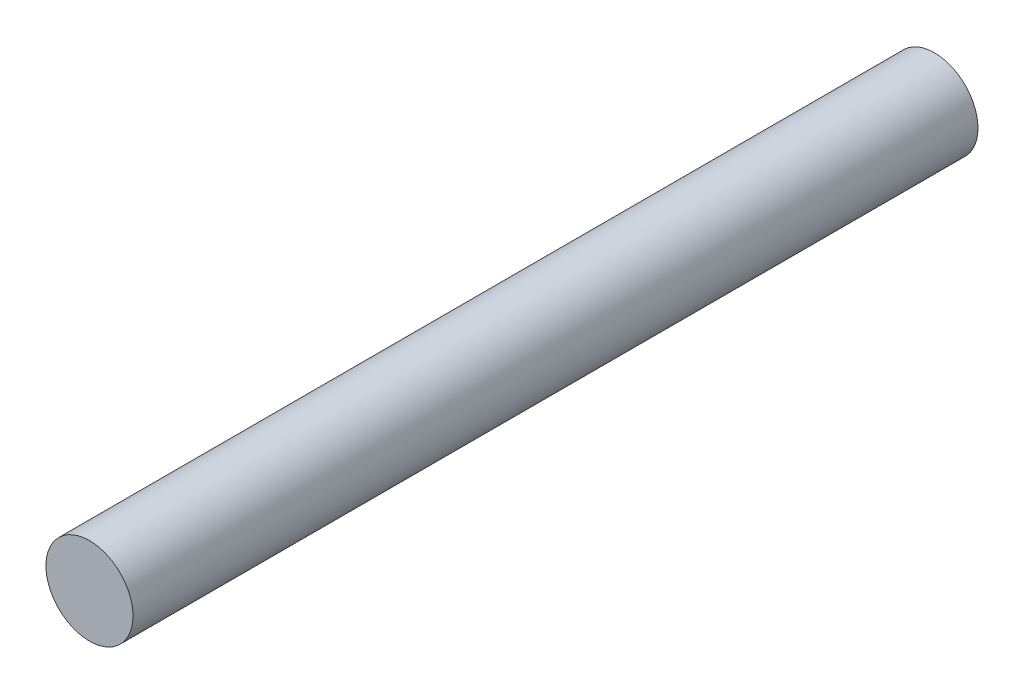
ISO-10303-21;
HEADER;
FILE_DESCRIPTION(('STEP AP214'),'2;1');
FILE_NAME('part.step','',(''),(''),'','','');
FILE_SCHEMA(('AUTOMOTIVE_DESIGN { 1 0 10303 214 1 1 1 1 }'));
ENDSEC;
DATA;
#1=APPLICATION_CONTEXT('core data for automotive mechanical design processes');
#2=APPLICATION_PROTOCOL_DEFINITION('international standard','automotive_design',2000,#1);
#3=PRODUCT_CONTEXT('',#1,'mechanical');
#4=PRODUCT('Part','Part','',(#3));
#5=PRODUCT_RELATED_PRODUCT_CATEGORY('part','',(#4));
#6=PRODUCT_DEFINITION_FORMATION('','',#4);
#7=PRODUCT_DEFINITION_CONTEXT('part definition',#1,'design');
#8=PRODUCT_DEFINITION('design','',#6,#7);
#9=PRODUCT_DEFINITION_SHAPE('','',#8);
#10=(LENGTH_UNIT() NAMED_UNIT(*) SI_UNIT(.MILLI.,.METRE.));
#11=(NAMED_UNIT(*) PLANE_ANGLE_UNIT() SI_UNIT($,.RADIAN.));
#12=(NAMED_UNIT(*) SI_UNIT($,.STERADIAN.) SOLID_ANGLE_UNIT());
#13=UNCERTAINTY_MEASURE_WITH_UNIT(LENGTH_MEASURE(1.E-05),#10,'distance_accuracy_value','');
#14=(GEOMETRIC_REPRESENTATION_CONTEXT(3) GLOBAL_UNCERTAINTY_ASSIGNED_CONTEXT((#13)) GLOBAL_UNIT_ASSIGNED_CONTEXT((#10,
#11,#12)) REPRESENTATION_CONTEXT('',''));
#15=CARTESIAN_POINT('',(0.,0.,0.));
#16=DIRECTION('',(0.,0.,1.));
#17=DIRECTION('',(1.,0.,0.));
#18=AXIS2_PLACEMENT_3D('',#15,#16,#17);
#19=CARTESIAN_POINT('',(0.,0.,61.595));
#20=DIRECTION('',(0.,0.,-1.));
#21=DIRECTION('',(-1.,0.,0.));
#22=AXIS2_PLACEMENT_3D('',#19,#20,#21);
#23=CYLINDRICAL_SURFACE('',#22,3.175);
#24=CARTESIAN_POINT('',(0.,0.,61.595));
#25=DIRECTION('',(0.,0.,1.));
#26=DIRECTION('',(1.,0.,0.));
#27=AXIS2_PLACEMENT_3D('',#24,#25,#26);
#28=CIRCLE('',#27,3.175);
#29=CARTESIAN_POINT('',(3.175,0.,61.595));
#30=VERTEX_POINT('',#29);
#31=EDGE_CURVE('E10',#30,#30,#28,.T.);
#32=ORIENTED_EDGE('',*,*,#31,.F.);
#33=EDGE_LOOP('',(#32));
#34=FACE_BOUND('',#33,.T.);
#35=CARTESIAN_POINT('',(0.,0.,0.));
#36=DIRECTION('',(0.,0.,1.));
#37=DIRECTION('',(1.,0.,0.));
#38=AXIS2_PLACEMENT_3D('',#35,#36,#37);
#39=CIRCLE('',#38,3.175);
#40=CARTESIAN_POINT('',(3.175,0.,0.));
#41=VERTEX_POINT('',#40);
#42=EDGE_CURVE('E34',#41,#41,#39,.T.);
#43=ORIENTED_EDGE('',*,*,#42,.T.);
#44=EDGE_LOOP('',(#43));
#45=FACE_BOUND('',#44,.T.);
#46=ADVANCED_FACE('F31',(#34,#45),#23,.T.);
#47=CARTESIAN_POINT('',(0.,0.,61.595));
#48=DIRECTION('',(0.,0.,1.));
#49=DIRECTION('',(1.,0.,0.));
#50=AXIS2_PLACEMENT_3D('',#47,#48,#49);
#51=PLANE('',#50);
#52=ORIENTED_EDGE('',*,*,#31,.T.);
#53=EDGE_LOOP('',(#52));
#54=FACE_BOUND('',#53,.T.);
#55=ADVANCED_FACE('F46',(#54),#51,.T.);
#56=CARTESIAN_POINT('',(0.,0.,0.));
#57=DIRECTION('',(0.,0.,1.));
#58=DIRECTION('',(1.,0.,0.));
#59=AXIS2_PLACEMENT_3D('',#56,#57,#58);
#60=PLANE('',#59);
#61=ORIENTED_EDGE('',*,*,#42,.F.);
#62=EDGE_LOOP('',(#61));
#63=FACE_BOUND('',#62,.T.);
#64=ADVANCED_FACE('F44',(#63),#60,.F.);
#65=CLOSED_SHELL('',(#46,#55,#64));
#66=MANIFOLD_SOLID_BREP('B2',#65);
#67=ADVANCED_BREP_SHAPE_REPRESENTATION('',(#18,#66),#14);
#68=SHAPE_DEFINITION_REPRESENTATION(#9,#67);
ENDSEC;
END-ISO-10303-21;
